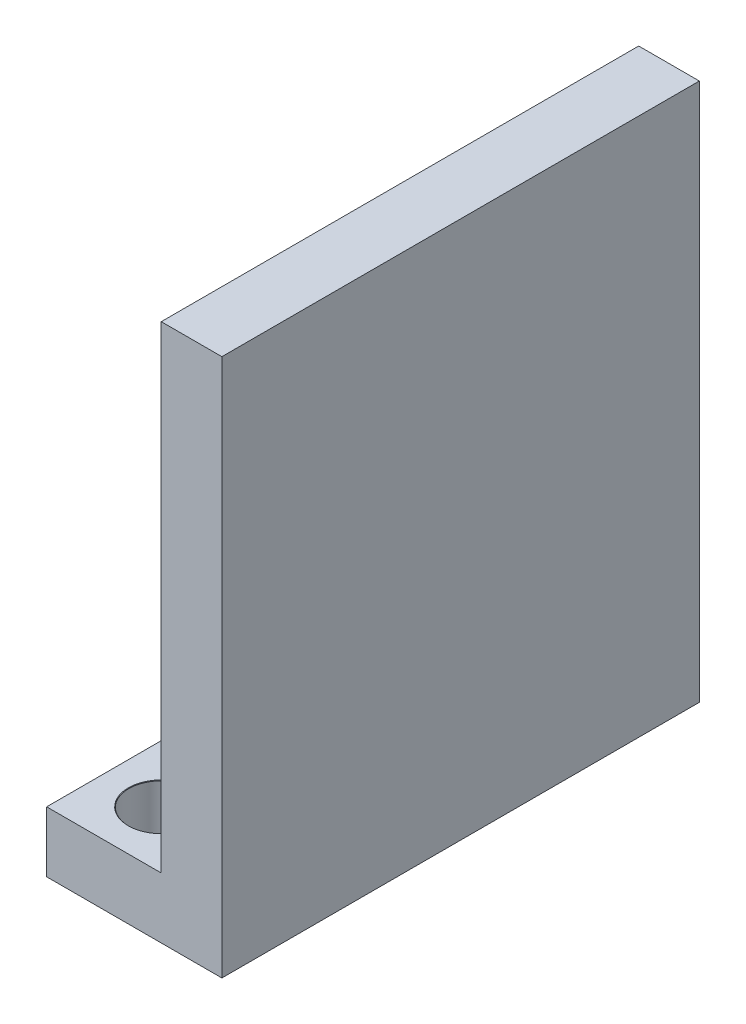
ISO-10303-21;
HEADER;
FILE_DESCRIPTION(('STEP AP214'),'2;1');
FILE_NAME('part.step','',(''),(''),'','','');
FILE_SCHEMA(('AUTOMOTIVE_DESIGN { 1 0 10303 214 1 1 1 1 }'));
ENDSEC;
DATA;
#1=APPLICATION_CONTEXT('core data for automotive mechanical design processes');
#2=APPLICATION_PROTOCOL_DEFINITION('international standard','automotive_design',2000,#1);
#3=PRODUCT_CONTEXT('',#1,'mechanical');
#4=PRODUCT('Part','Part','',(#3));
#5=PRODUCT_RELATED_PRODUCT_CATEGORY('part','',(#4));
#6=PRODUCT_DEFINITION_FORMATION('','',#4);
#7=PRODUCT_DEFINITION_CONTEXT('part definition',#1,'design');
#8=PRODUCT_DEFINITION('design','',#6,#7);
#9=PRODUCT_DEFINITION_SHAPE('','',#8);
#10=(LENGTH_UNIT() NAMED_UNIT(*) SI_UNIT(.MILLI.,.METRE.));
#11=(NAMED_UNIT(*) PLANE_ANGLE_UNIT() SI_UNIT($,.RADIAN.));
#12=(NAMED_UNIT(*) SI_UNIT($,.STERADIAN.) SOLID_ANGLE_UNIT());
#13=UNCERTAINTY_MEASURE_WITH_UNIT(LENGTH_MEASURE(1.E-05),#10,'distance_accuracy_value','');
#14=(GEOMETRIC_REPRESENTATION_CONTEXT(3) GLOBAL_UNCERTAINTY_ASSIGNED_CONTEXT((#13)) GLOBAL_UNIT_ASSIGNED_CONTEXT((#10,
#11,#12)) REPRESENTATION_CONTEXT('',''));
#15=CARTESIAN_POINT('',(0.,0.,0.));
#16=DIRECTION('',(0.,0.,1.));
#17=DIRECTION('',(1.,0.,0.));
#18=AXIS2_PLACEMENT_3D('',#15,#16,#17);
#19=CARTESIAN_POINT('',(0.,3.175,0.));
#20=DIRECTION('',(0.,-1.,0.));
#21=DIRECTION('',(0.,0.,-1.));
#22=AXIS2_PLACEMENT_3D('',#19,#20,#21);
#23=PLANE('',#22);
#24=CARTESIAN_POINT('',(3.,3.175,-22.));
#25=DIRECTION('',(0.,1.,0.));
#26=DIRECTION('',(0.,0.,1.));
#27=AXIS2_PLACEMENT_3D('',#24,#25,#26);
#28=CIRCLE('',#27,1.725);
#29=CARTESIAN_POINT('',(3.,3.175,-20.275));
#30=VERTEX_POINT('',#29);
#31=EDGE_CURVE('E189',#30,#30,#28,.T.);
#32=ORIENTED_EDGE('',*,*,#31,.F.);
#33=EDGE_LOOP('',(#32));
#34=FACE_BOUND('',#33,.T.);
#35=CARTESIAN_POINT('',(3.,3.175,-3.));
#36=DIRECTION('',(0.,1.,0.));
#37=DIRECTION('',(0.,0.,1.));
#38=AXIS2_PLACEMENT_3D('',#35,#36,#37);
#39=CIRCLE('',#38,1.725);
#40=CARTESIAN_POINT('',(3.,3.175,-1.275));
#41=VERTEX_POINT('',#40);
#42=EDGE_CURVE('E177',#41,#41,#39,.T.);
#43=ORIENTED_EDGE('',*,*,#42,.F.);
#44=EDGE_LOOP('',(#43));
#45=FACE_BOUND('',#44,.T.);
#46=DIRECTION('',(0.,0.,1.));
#47=VECTOR('',#46,1.);
#48=CARTESIAN_POINT('',(6.,3.175,0.));
#49=LINE('',#48,#47);
#50=CARTESIAN_POINT('',(6.,3.175,-25.));
#51=VERTEX_POINT('',#50);
#52=CARTESIAN_POINT('',(6.,3.175,0.));
#53=VERTEX_POINT('',#52);
#54=EDGE_CURVE('E55',#51,#53,#49,.T.);
#55=ORIENTED_EDGE('',*,*,#54,.F.);
#56=DIRECTION('',(-1.,0.,0.));
#57=VECTOR('',#56,1.);
#58=CARTESIAN_POINT('',(0.,3.175,-25.));
#59=LINE('',#58,#57);
#60=CARTESIAN_POINT('',(0.,3.175,-25.));
#61=VERTEX_POINT('',#60);
#62=EDGE_CURVE('E60',#51,#61,#59,.T.);
#63=ORIENTED_EDGE('',*,*,#62,.T.);
#64=DIRECTION('',(0.,0.,1.));
#65=VECTOR('',#64,1.);
#66=CARTESIAN_POINT('',(0.,3.175,0.));
#67=LINE('',#66,#65);
#68=CARTESIAN_POINT('',(0.,3.175,0.));
#69=VERTEX_POINT('',#68);
#70=EDGE_CURVE('E92',#61,#69,#67,.T.);
#71=ORIENTED_EDGE('',*,*,#70,.T.);
#72=DIRECTION('',(1.,0.,0.));
#73=VECTOR('',#72,1.);
#74=CARTESIAN_POINT('',(0.,3.175,0.));
#75=LINE('',#74,#73);
#76=EDGE_CURVE('E155',#69,#53,#75,.T.);
#77=ORIENTED_EDGE('',*,*,#76,.T.);
#78=EDGE_LOOP('',(#55,#63,#71,#77));
#79=FACE_BOUND('',#78,.T.);
#80=ADVANCED_FACE('F39',(#34,#45,#79),#23,.F.);
#81=CARTESIAN_POINT('',(0.,3.175,0.));
#82=DIRECTION('',(1.,0.,0.));
#83=DIRECTION('',(0.,0.,-1.));
#84=AXIS2_PLACEMENT_3D('',#81,#82,#83);
#85=PLANE('',#84);
#86=DIRECTION('',(0.,0.,1.));
#87=VECTOR('',#86,1.);
#88=CARTESIAN_POINT('',(0.,0.,0.));
#89=LINE('',#88,#87);
#90=CARTESIAN_POINT('',(0.,0.,-25.));
#91=VERTEX_POINT('',#90);
#92=CARTESIAN_POINT('',(0.,0.,0.));
#93=VERTEX_POINT('',#92);
#94=EDGE_CURVE('E98',#91,#93,#89,.T.);
#95=ORIENTED_EDGE('',*,*,#94,.T.);
#96=DIRECTION('',(0.,-1.,0.));
#97=VECTOR('',#96,1.);
#98=CARTESIAN_POINT('',(0.,3.175,0.));
#99=LINE('',#98,#97);
#100=EDGE_CURVE('E11',#69,#93,#99,.T.);
#101=ORIENTED_EDGE('',*,*,#100,.F.);
#102=ORIENTED_EDGE('',*,*,#70,.F.);
#103=DIRECTION('',(0.,-1.,0.));
#104=VECTOR('',#103,1.);
#105=CARTESIAN_POINT('',(0.,3.175,-25.));
#106=LINE('',#105,#104);
#107=EDGE_CURVE('E83',#61,#91,#106,.T.);
#108=ORIENTED_EDGE('',*,*,#107,.T.);
#109=EDGE_LOOP('',(#95,#101,#102,#108));
#110=FACE_BOUND('',#109,.T.);
#111=ADVANCED_FACE('F41',(#110),#85,.F.);
#112=CARTESIAN_POINT('',(0.,3.175,0.));
#113=DIRECTION('',(0.,0.,-1.));
#114=DIRECTION('',(-1.,0.,0.));
#115=AXIS2_PLACEMENT_3D('',#112,#113,#114);
#116=PLANE('',#115);
#117=DIRECTION('',(1.,0.,0.));
#118=VECTOR('',#117,1.);
#119=CARTESIAN_POINT('',(0.,0.,0.));
#120=LINE('',#119,#118);
#121=CARTESIAN_POINT('',(9.175,0.,0.));
#122=VERTEX_POINT('',#121);
#123=EDGE_CURVE('E102',#93,#122,#120,.T.);
#124=ORIENTED_EDGE('',*,*,#123,.T.);
#125=DIRECTION('',(0.,-1.,0.));
#126=VECTOR('',#125,1.);
#127=CARTESIAN_POINT('',(9.175,3.175,0.));
#128=LINE('',#127,#126);
#129=CARTESIAN_POINT('',(9.175,28.175,0.));
#130=VERTEX_POINT('',#129);
#131=EDGE_CURVE('E48',#130,#122,#128,.T.);
#132=ORIENTED_EDGE('',*,*,#131,.F.);
#133=DIRECTION('',(1.,0.,0.));
#134=VECTOR('',#133,1.);
#135=CARTESIAN_POINT('',(9.175,28.175,0.));
#136=LINE('',#135,#134);
#137=CARTESIAN_POINT('',(6.,28.175,0.));
#138=VERTEX_POINT('',#137);
#139=EDGE_CURVE('E132',#138,#130,#136,.T.);
#140=ORIENTED_EDGE('',*,*,#139,.F.);
#141=DIRECTION('',(0.,-1.,0.));
#142=VECTOR('',#141,1.);
#143=CARTESIAN_POINT('',(6.,28.175,0.));
#144=LINE('',#143,#142);
#145=EDGE_CURVE('E110',#138,#53,#144,.T.);
#146=ORIENTED_EDGE('',*,*,#145,.T.);
#147=ORIENTED_EDGE('',*,*,#76,.F.);
#148=ORIENTED_EDGE('',*,*,#100,.T.);
#149=EDGE_LOOP('',(#124,#132,#140,#146,#147,#148));
#150=FACE_BOUND('',#149,.T.);
#151=ADVANCED_FACE('F129',(#150),#116,.F.);
#152=CARTESIAN_POINT('',(9.175,3.175,0.));
#153=DIRECTION('',(-1.,0.,0.));
#154=DIRECTION('',(0.,0.,1.));
#155=AXIS2_PLACEMENT_3D('',#152,#153,#154);
#156=PLANE('',#155);
#157=DIRECTION('',(0.,0.,-1.));
#158=VECTOR('',#157,1.);
#159=CARTESIAN_POINT('',(9.175,0.,0.));
#160=LINE('',#159,#158);
#161=CARTESIAN_POINT('',(9.175,0.,-25.));
#162=VERTEX_POINT('',#161);
#163=EDGE_CURVE('E93',#122,#162,#160,.T.);
#164=ORIENTED_EDGE('',*,*,#163,.T.);
#165=DIRECTION('',(0.,-1.,0.));
#166=VECTOR('',#165,1.);
#167=CARTESIAN_POINT('',(9.175,3.175,-25.));
#168=LINE('',#167,#166);
#169=CARTESIAN_POINT('',(9.175,28.175,-25.));
#170=VERTEX_POINT('',#169);
#171=EDGE_CURVE('E87',#170,#162,#168,.T.);
#172=ORIENTED_EDGE('',*,*,#171,.F.);
#173=DIRECTION('',(0.,0.,-1.));
#174=VECTOR('',#173,1.);
#175=CARTESIAN_POINT('',(9.175,28.175,0.));
#176=LINE('',#175,#174);
#177=EDGE_CURVE('E125',#130,#170,#176,.T.);
#178=ORIENTED_EDGE('',*,*,#177,.F.);
#179=ORIENTED_EDGE('',*,*,#131,.T.);
#180=EDGE_LOOP('',(#164,#172,#178,#179));
#181=FACE_BOUND('',#180,.T.);
#182=ADVANCED_FACE('F123',(#181),#156,.F.);
#183=CARTESIAN_POINT('',(0.,3.175,-25.));
#184=DIRECTION('',(0.,0.,1.));
#185=DIRECTION('',(1.,0.,0.));
#186=AXIS2_PLACEMENT_3D('',#183,#184,#185);
#187=PLANE('',#186);
#188=DIRECTION('',(-1.,0.,0.));
#189=VECTOR('',#188,1.);
#190=CARTESIAN_POINT('',(0.,0.,-25.));
#191=LINE('',#190,#189);
#192=EDGE_CURVE('E80',#162,#91,#191,.T.);
#193=ORIENTED_EDGE('',*,*,#192,.T.);
#194=ORIENTED_EDGE('',*,*,#107,.F.);
#195=ORIENTED_EDGE('',*,*,#62,.F.);
#196=DIRECTION('',(0.,-1.,0.));
#197=VECTOR('',#196,1.);
#198=CARTESIAN_POINT('',(6.,28.175,-25.));
#199=LINE('',#198,#197);
#200=CARTESIAN_POINT('',(6.,28.175,-25.));
#201=VERTEX_POINT('',#200);
#202=EDGE_CURVE('E104',#201,#51,#199,.T.);
#203=ORIENTED_EDGE('',*,*,#202,.F.);
#204=DIRECTION('',(-1.,0.,0.));
#205=VECTOR('',#204,1.);
#206=CARTESIAN_POINT('',(9.175,28.175,-25.));
#207=LINE('',#206,#205);
#208=EDGE_CURVE('E147',#170,#201,#207,.T.);
#209=ORIENTED_EDGE('',*,*,#208,.F.);
#210=ORIENTED_EDGE('',*,*,#171,.T.);
#211=EDGE_LOOP('',(#193,#194,#195,#203,#209,#210));
#212=FACE_BOUND('',#211,.T.);
#213=ADVANCED_FACE('F82',(#212),#187,.F.);
#214=CARTESIAN_POINT('',(0.,0.,0.));
#215=DIRECTION('',(0.,-1.,0.));
#216=DIRECTION('',(0.,0.,-1.));
#217=AXIS2_PLACEMENT_3D('',#214,#215,#216);
#218=PLANE('',#217);
#219=CARTESIAN_POINT('',(3.,0.,-22.));
#220=DIRECTION('',(0.,1.,0.));
#221=DIRECTION('',(0.,0.,1.));
#222=AXIS2_PLACEMENT_3D('',#219,#220,#221);
#223=CIRCLE('',#222,1.7);
#224=CARTESIAN_POINT('',(3.,0.,-20.3));
#225=VERTEX_POINT('',#224);
#226=EDGE_CURVE('E181',#225,#225,#223,.T.);
#227=ORIENTED_EDGE('',*,*,#226,.T.);
#228=EDGE_LOOP('',(#227));
#229=FACE_BOUND('',#228,.T.);
#230=CARTESIAN_POINT('',(3.,0.,-3.));
#231=DIRECTION('',(0.,1.,0.));
#232=DIRECTION('',(0.,0.,1.));
#233=AXIS2_PLACEMENT_3D('',#230,#231,#232);
#234=CIRCLE('',#233,1.7);
#235=CARTESIAN_POINT('',(3.,0.,-1.3));
#236=VERTEX_POINT('',#235);
#237=EDGE_CURVE('E152',#236,#236,#234,.T.);
#238=ORIENTED_EDGE('',*,*,#237,.T.);
#239=EDGE_LOOP('',(#238));
#240=FACE_BOUND('',#239,.T.);
#241=ORIENTED_EDGE('',*,*,#94,.F.);
#242=ORIENTED_EDGE('',*,*,#192,.F.);
#243=ORIENTED_EDGE('',*,*,#163,.F.);
#244=ORIENTED_EDGE('',*,*,#123,.F.);
#245=EDGE_LOOP('',(#241,#242,#243,#244));
#246=FACE_BOUND('',#245,.T.);
#247=ADVANCED_FACE('F101',(#229,#240,#246),#218,.T.);
#248=CARTESIAN_POINT('',(6.,28.175,0.));
#249=DIRECTION('',(1.,0.,0.));
#250=DIRECTION('',(0.,0.,-1.));
#251=AXIS2_PLACEMENT_3D('',#248,#249,#250);
#252=PLANE('',#251);
#253=ORIENTED_EDGE('',*,*,#54,.T.);
#254=ORIENTED_EDGE('',*,*,#145,.F.);
#255=DIRECTION('',(0.,0.,1.));
#256=VECTOR('',#255,1.);
#257=CARTESIAN_POINT('',(6.,28.175,0.));
#258=LINE('',#257,#256);
#259=EDGE_CURVE('E140',#201,#138,#258,.T.);
#260=ORIENTED_EDGE('',*,*,#259,.F.);
#261=ORIENTED_EDGE('',*,*,#202,.T.);
#262=EDGE_LOOP('',(#253,#254,#260,#261));
#263=FACE_BOUND('',#262,.T.);
#264=ADVANCED_FACE('F160',(#263),#252,.F.);
#265=CARTESIAN_POINT('',(0.,28.175,0.));
#266=DIRECTION('',(0.,1.,0.));
#267=DIRECTION('',(0.,0.,1.));
#268=AXIS2_PLACEMENT_3D('',#265,#266,#267);
#269=PLANE('',#268);
#270=ORIENTED_EDGE('',*,*,#177,.T.);
#271=ORIENTED_EDGE('',*,*,#208,.T.);
#272=ORIENTED_EDGE('',*,*,#259,.T.);
#273=ORIENTED_EDGE('',*,*,#139,.T.);
#274=EDGE_LOOP('',(#270,#271,#272,#273));
#275=FACE_BOUND('',#274,.T.);
#276=ADVANCED_FACE('F136',(#275),#269,.T.);
#277=CARTESIAN_POINT('',(3.,3.175,-3.));
#278=DIRECTION('',(0.,1.,0.));
#279=DIRECTION('',(0.,0.,1.));
#280=AXIS2_PLACEMENT_3D('',#277,#278,#279);
#281=CYLINDRICAL_SURFACE('',#280,1.7);
#282=ORIENTED_EDGE('',*,*,#237,.F.);
#283=EDGE_LOOP('',(#282));
#284=FACE_BOUND('',#283,.T.);
#285=CARTESIAN_POINT('',(3.,3.15,-3.));
#286=DIRECTION('',(0.,1.,0.));
#287=DIRECTION('',(0.,0.,1.));
#288=AXIS2_PLACEMENT_3D('',#285,#286,#287);
#289=CIRCLE('',#288,1.7);
#290=CARTESIAN_POINT('',(3.,3.15,-1.3));
#291=VERTEX_POINT('',#290);
#292=EDGE_CURVE('E173',#291,#291,#289,.T.);
#293=ORIENTED_EDGE('',*,*,#292,.T.);
#294=EDGE_LOOP('',(#293));
#295=FACE_BOUND('',#294,.T.);
#296=ADVANCED_FACE('F204',(#284,#295),#281,.F.);
#297=CARTESIAN_POINT('',(3.,3.175,-3.));
#298=DIRECTION('',(0.,1.,0.));
#299=DIRECTION('',(0.,0.,1.));
#300=AXIS2_PLACEMENT_3D('',#297,#298,#299);
#301=CONICAL_SURFACE('',#300,1.725,0.785398163397431);
#302=ORIENTED_EDGE('',*,*,#292,.F.);
#303=EDGE_LOOP('',(#302));
#304=FACE_BOUND('',#303,.T.);
#305=ORIENTED_EDGE('',*,*,#42,.T.);
#306=EDGE_LOOP('',(#305));
#307=FACE_BOUND('',#306,.T.);
#308=ADVANCED_FACE('F201',(#304,#307),#301,.F.);
#309=CARTESIAN_POINT('',(3.,3.175,-22.));
#310=DIRECTION('',(0.,1.,0.));
#311=DIRECTION('',(0.,0.,1.));
#312=AXIS2_PLACEMENT_3D('',#309,#310,#311);
#313=CYLINDRICAL_SURFACE('',#312,1.7);
#314=ORIENTED_EDGE('',*,*,#226,.F.);
#315=EDGE_LOOP('',(#314));
#316=FACE_BOUND('',#315,.T.);
#317=CARTESIAN_POINT('',(3.,3.15,-22.));
#318=DIRECTION('',(0.,1.,0.));
#319=DIRECTION('',(0.,0.,1.));
#320=AXIS2_PLACEMENT_3D('',#317,#318,#319);
#321=CIRCLE('',#320,1.7);
#322=CARTESIAN_POINT('',(3.,3.15,-20.3));
#323=VERTEX_POINT('',#322);
#324=EDGE_CURVE('E185',#323,#323,#321,.T.);
#325=ORIENTED_EDGE('',*,*,#324,.T.);
#326=EDGE_LOOP('',(#325));
#327=FACE_BOUND('',#326,.T.);
#328=ADVANCED_FACE('F203',(#316,#327),#313,.F.);
#329=CARTESIAN_POINT('',(3.,3.175,-22.));
#330=DIRECTION('',(0.,1.,0.));
#331=DIRECTION('',(0.,0.,1.));
#332=AXIS2_PLACEMENT_3D('',#329,#330,#331);
#333=CONICAL_SURFACE('',#332,1.725,0.785398163397431);
#334=ORIENTED_EDGE('',*,*,#324,.F.);
#335=EDGE_LOOP('',(#334));
#336=FACE_BOUND('',#335,.T.);
#337=ORIENTED_EDGE('',*,*,#31,.T.);
#338=EDGE_LOOP('',(#337));
#339=FACE_BOUND('',#338,.T.);
#340=ADVANCED_FACE('F194',(#336,#339),#333,.F.);
#341=CLOSED_SHELL('',(#80,#111,#151,#182,#213,#247,#264,#276,#296,#308,#328,#340));
#342=MANIFOLD_SOLID_BREP('B2',#341);
#343=ADVANCED_BREP_SHAPE_REPRESENTATION('',(#18,#342),#14);
#344=SHAPE_DEFINITION_REPRESENTATION(#9,#343);
ENDSEC;
END-ISO-10303-21;
